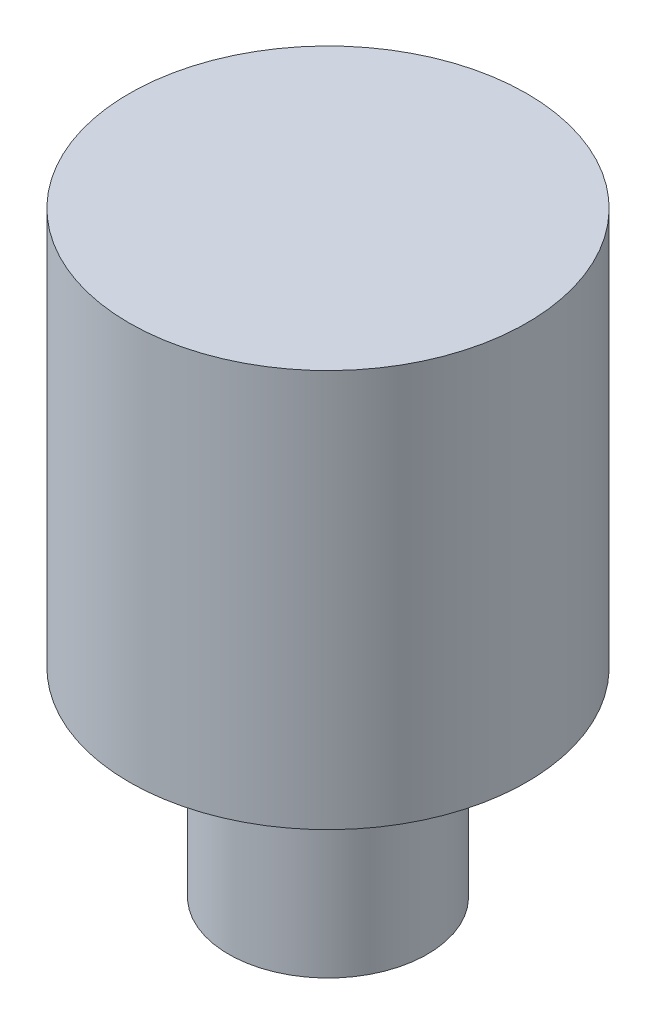
ISO-10303-21;
HEADER;
FILE_DESCRIPTION(('STEP AP214'),'2;1');
FILE_NAME('part.step','',(''),(''),'','','');
FILE_SCHEMA(('AUTOMOTIVE_DESIGN { 1 0 10303 214 1 1 1 1 }'));
ENDSEC;
DATA;
#1=APPLICATION_CONTEXT('core data for automotive mechanical design processes');
#2=APPLICATION_PROTOCOL_DEFINITION('international standard','automotive_design',2000,#1);
#3=PRODUCT_CONTEXT('',#1,'mechanical');
#4=PRODUCT('Part','Part','',(#3));
#5=PRODUCT_RELATED_PRODUCT_CATEGORY('part','',(#4));
#6=PRODUCT_DEFINITION_FORMATION('','',#4);
#7=PRODUCT_DEFINITION_CONTEXT('part definition',#1,'design');
#8=PRODUCT_DEFINITION('design','',#6,#7);
#9=PRODUCT_DEFINITION_SHAPE('','',#8);
#10=(LENGTH_UNIT() NAMED_UNIT(*) SI_UNIT(.MILLI.,.METRE.));
#11=(NAMED_UNIT(*) PLANE_ANGLE_UNIT() SI_UNIT($,.RADIAN.));
#12=(NAMED_UNIT(*) SI_UNIT($,.STERADIAN.) SOLID_ANGLE_UNIT());
#13=UNCERTAINTY_MEASURE_WITH_UNIT(LENGTH_MEASURE(1.E-05),#10,'distance_accuracy_value','');
#14=(GEOMETRIC_REPRESENTATION_CONTEXT(3) GLOBAL_UNCERTAINTY_ASSIGNED_CONTEXT((#13)) GLOBAL_UNIT_ASSIGNED_CONTEXT((#10,
#11,#12)) REPRESENTATION_CONTEXT('',''));
#15=CARTESIAN_POINT('',(0.,0.,0.));
#16=DIRECTION('',(0.,0.,1.));
#17=DIRECTION('',(1.,0.,0.));
#18=AXIS2_PLACEMENT_3D('',#15,#16,#17);
#19=CARTESIAN_POINT('',(0.,6.,0.));
#20=DIRECTION('',(0.,1.,0.));
#21=DIRECTION('',(0.,0.,1.));
#22=AXIS2_PLACEMENT_3D('',#19,#20,#21);
#23=PLANE('',#22);
#24=CARTESIAN_POINT('',(0.,6.,0.));
#25=DIRECTION('',(0.,-1.,0.));
#26=DIRECTION('',(0.,0.,-1.));
#27=AXIS2_PLACEMENT_3D('',#24,#25,#26);
#28=CIRCLE('',#27,2.);
#29=CARTESIAN_POINT('',(0.,6.,-2.));
#30=VERTEX_POINT('',#29);
#31=EDGE_CURVE('E10',#30,#30,#28,.T.);
#32=ORIENTED_EDGE('',*,*,#31,.F.);
#33=EDGE_LOOP('',(#32));
#34=FACE_BOUND('',#33,.T.);
#35=ADVANCED_FACE('F31',(#34),#23,.T.);
#36=CARTESIAN_POINT('',(0.,0.,0.));
#37=DIRECTION('',(0.,-1.,0.));
#38=DIRECTION('',(0.,0.,-1.));
#39=AXIS2_PLACEMENT_3D('',#36,#37,#38);
#40=CYLINDRICAL_SURFACE('',#39,2.);
#41=CARTESIAN_POINT('',(0.,2.,0.));
#42=DIRECTION('',(0.,-1.,0.));
#43=DIRECTION('',(0.,0.,-1.));
#44=AXIS2_PLACEMENT_3D('',#41,#42,#43);
#45=CIRCLE('',#44,2.);
#46=CARTESIAN_POINT('',(0.,2.,-2.));
#47=VERTEX_POINT('',#46);
#48=EDGE_CURVE('E41',#47,#47,#45,.T.);
#49=ORIENTED_EDGE('',*,*,#48,.F.);
#50=EDGE_LOOP('',(#49));
#51=FACE_BOUND('',#50,.T.);
#52=ORIENTED_EDGE('',*,*,#31,.T.);
#53=EDGE_LOOP('',(#52));
#54=FACE_BOUND('',#53,.T.);
#55=ADVANCED_FACE('F56',(#51,#54),#40,.T.);
#56=CARTESIAN_POINT('',(0.,0.,0.));
#57=DIRECTION('',(0.,-1.,0.));
#58=DIRECTION('',(0.,0.,-1.));
#59=AXIS2_PLACEMENT_3D('',#56,#57,#58);
#60=CYLINDRICAL_SURFACE('',#59,1.);
#61=CARTESIAN_POINT('',(0.,0.,0.));
#62=DIRECTION('',(0.,-1.,0.));
#63=DIRECTION('',(0.,0.,-1.));
#64=AXIS2_PLACEMENT_3D('',#61,#62,#63);
#65=CIRCLE('',#64,1.);
#66=CARTESIAN_POINT('',(0.,0.,-1.));
#67=VERTEX_POINT('',#66);
#68=EDGE_CURVE('E45',#67,#67,#65,.T.);
#69=ORIENTED_EDGE('',*,*,#68,.F.);
#70=EDGE_LOOP('',(#69));
#71=FACE_BOUND('',#70,.T.);
#72=CARTESIAN_POINT('',(0.,2.,0.));
#73=DIRECTION('',(0.,-1.,0.));
#74=DIRECTION('',(0.,0.,-1.));
#75=AXIS2_PLACEMENT_3D('',#72,#73,#74);
#76=CIRCLE('',#75,1.);
#77=CARTESIAN_POINT('',(0.,2.,-1.));
#78=VERTEX_POINT('',#77);
#79=EDGE_CURVE('E37',#78,#78,#76,.T.);
#80=ORIENTED_EDGE('',*,*,#79,.T.);
#81=EDGE_LOOP('',(#80));
#82=FACE_BOUND('',#81,.T.);
#83=ADVANCED_FACE('F53',(#71,#82),#60,.T.);
#84=CARTESIAN_POINT('',(1.,2.,0.));
#85=DIRECTION('',(0.,1.,0.));
#86=DIRECTION('',(0.,0.,1.));
#87=AXIS2_PLACEMENT_3D('',#84,#85,#86);
#88=PLANE('',#87);
#89=ORIENTED_EDGE('',*,*,#79,.F.);
#90=EDGE_LOOP('',(#89));
#91=FACE_BOUND('',#90,.T.);
#92=ORIENTED_EDGE('',*,*,#48,.T.);
#93=EDGE_LOOP('',(#92));
#94=FACE_BOUND('',#93,.T.);
#95=ADVANCED_FACE('F55',(#91,#94),#88,.F.);
#96=CARTESIAN_POINT('',(0.,0.,0.));
#97=DIRECTION('',(0.,-1.,0.));
#98=DIRECTION('',(0.,0.,-1.));
#99=AXIS2_PLACEMENT_3D('',#96,#97,#98);
#100=PLANE('',#99);
#101=ORIENTED_EDGE('',*,*,#68,.T.);
#102=EDGE_LOOP('',(#101));
#103=FACE_BOUND('',#102,.T.);
#104=ADVANCED_FACE('F51',(#103),#100,.T.);
#105=CLOSED_SHELL('',(#35,#55,#83,#95,#104));
#106=MANIFOLD_SOLID_BREP('B2',#105);
#107=ADVANCED_BREP_SHAPE_REPRESENTATION('',(#18,#106),#14);
#108=SHAPE_DEFINITION_REPRESENTATION(#9,#107);
ENDSEC;
END-ISO-10303-21;
